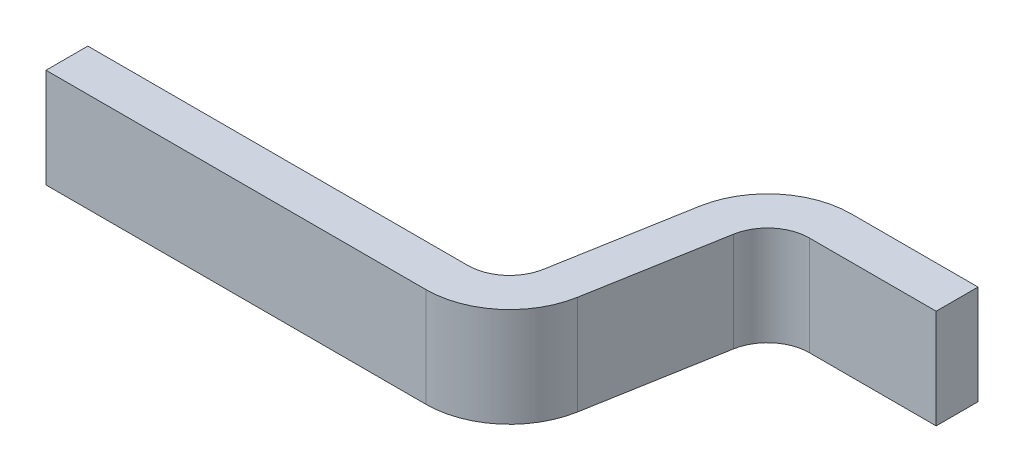
ISO-10303-21;
HEADER;
FILE_DESCRIPTION(('STEP AP214'),'2;1');
FILE_NAME('part.step','',(''),(''),'','','');
FILE_SCHEMA(('AUTOMOTIVE_DESIGN { 1 0 10303 214 1 1 1 1 }'));
ENDSEC;
DATA;
#1=APPLICATION_CONTEXT('core data for automotive mechanical design processes');
#2=APPLICATION_PROTOCOL_DEFINITION('international standard','automotive_design',2000,#1);
#3=PRODUCT_CONTEXT('',#1,'mechanical');
#4=PRODUCT('Part','Part','',(#3));
#5=PRODUCT_RELATED_PRODUCT_CATEGORY('part','',(#4));
#6=PRODUCT_DEFINITION_FORMATION('','',#4);
#7=PRODUCT_DEFINITION_CONTEXT('part definition',#1,'design');
#8=PRODUCT_DEFINITION('design','',#6,#7);
#9=PRODUCT_DEFINITION_SHAPE('','',#8);
#10=(LENGTH_UNIT() NAMED_UNIT(*) SI_UNIT(.MILLI.,.METRE.));
#11=(NAMED_UNIT(*) PLANE_ANGLE_UNIT() SI_UNIT($,.RADIAN.));
#12=(NAMED_UNIT(*) SI_UNIT($,.STERADIAN.) SOLID_ANGLE_UNIT());
#13=UNCERTAINTY_MEASURE_WITH_UNIT(LENGTH_MEASURE(1.E-05),#10,'distance_accuracy_value','');
#14=(GEOMETRIC_REPRESENTATION_CONTEXT(3) GLOBAL_UNCERTAINTY_ASSIGNED_CONTEXT((#13)) GLOBAL_UNIT_ASSIGNED_CONTEXT((#10,
#11,#12)) REPRESENTATION_CONTEXT('',''));
#15=CARTESIAN_POINT('',(0.,0.,0.));
#16=DIRECTION('',(0.,0.,1.));
#17=DIRECTION('',(1.,0.,0.));
#18=AXIS2_PLACEMENT_3D('',#15,#16,#17);
#19=CARTESIAN_POINT('',(2.518923101205,0.2375,0.2));
#20=DIRECTION('',(0.,0.,-1.));
#21=DIRECTION('',(-1.,0.,0.));
#22=AXIS2_PLACEMENT_3D('',#19,#20,#21);
#23=PLANE('',#22);
#24=DIRECTION('',(1.,0.,0.));
#25=VECTOR('',#24,1.);
#26=CARTESIAN_POINT('',(2.518923101205,0.2375,0.2));
#27=LINE('',#26,#25);
#28=CARTESIAN_POINT('',(3.125,0.2375,0.2));
#29=VERTEX_POINT('',#28);
#30=CARTESIAN_POINT('',(2.518923101205,0.2375,0.2));
#31=VERTEX_POINT('',#30);
#32=EDGE_CURVE('E166',#29,#31,#27,.F.);
#33=ORIENTED_EDGE('',*,*,#32,.T.);
#34=DIRECTION('',(0.,-1.,0.));
#35=VECTOR('',#34,1.);
#36=CARTESIAN_POINT('',(2.518923101205,0.2375,0.2));
#37=LINE('',#36,#35);
#38=CARTESIAN_POINT('',(2.518923101205,-0.2375,0.2));
#39=VERTEX_POINT('',#38);
#40=EDGE_CURVE('E100',#31,#39,#37,.T.);
#41=ORIENTED_EDGE('',*,*,#40,.T.);
#42=DIRECTION('',(1.,0.,0.));
#43=VECTOR('',#42,1.);
#44=CARTESIAN_POINT('',(2.518923101205,-0.2375,0.2));
#45=LINE('',#44,#43);
#46=CARTESIAN_POINT('',(3.125,-0.2375,0.2));
#47=VERTEX_POINT('',#46);
#48=EDGE_CURVE('E145',#39,#47,#45,.T.);
#49=ORIENTED_EDGE('',*,*,#48,.T.);
#50=DIRECTION('',(0.,1.,0.));
#51=VECTOR('',#50,1.);
#52=CARTESIAN_POINT('',(3.125,-0.2375,0.2));
#53=LINE('',#52,#51);
#54=EDGE_CURVE('E163',#47,#29,#53,.T.);
#55=ORIENTED_EDGE('',*,*,#54,.T.);
#56=EDGE_LOOP('',(#33,#41,#49,#55));
#57=FACE_BOUND('',#56,.T.);
#58=ADVANCED_FACE('F16',(#57),#23,.F.);
#59=CARTESIAN_POINT('',(3.125,-0.2375,0.));
#60=DIRECTION('',(-1.,0.,0.));
#61=DIRECTION('',(0.,0.,1.));
#62=AXIS2_PLACEMENT_3D('',#59,#60,#61);
#63=PLANE('',#62);
#64=DIRECTION('',(0.,0.,1.));
#65=VECTOR('',#64,1.);
#66=CARTESIAN_POINT('',(3.125,0.2375,0.));
#67=LINE('',#66,#65);
#68=CARTESIAN_POINT('',(3.125,0.2375,0.));
#69=VERTEX_POINT('',#68);
#70=EDGE_CURVE('E149',#29,#69,#67,.F.);
#71=ORIENTED_EDGE('',*,*,#70,.F.);
#72=ORIENTED_EDGE('',*,*,#54,.F.);
#73=DIRECTION('',(0.,0.,1.));
#74=VECTOR('',#73,1.);
#75=CARTESIAN_POINT('',(3.125,-0.2375,0.2));
#76=LINE('',#75,#74);
#77=CARTESIAN_POINT('',(3.125,-0.2375,0.));
#78=VERTEX_POINT('',#77);
#79=EDGE_CURVE('E144',#47,#78,#76,.F.);
#80=ORIENTED_EDGE('',*,*,#79,.T.);
#81=DIRECTION('',(0.,1.,0.));
#82=VECTOR('',#81,1.);
#83=CARTESIAN_POINT('',(3.125,-0.2375,0.));
#84=LINE('',#83,#82);
#85=EDGE_CURVE('E135',#78,#69,#84,.T.);
#86=ORIENTED_EDGE('',*,*,#85,.T.);
#87=EDGE_LOOP('',(#71,#72,#80,#86));
#88=FACE_BOUND('',#87,.T.);
#89=ADVANCED_FACE('F297',(#88),#63,.F.);
#90=CARTESIAN_POINT('',(2.518923101205,0.2375,0.4));
#91=DIRECTION('',(0.,-1.,0.));
#92=DIRECTION('',(0.,0.,-1.));
#93=AXIS2_PLACEMENT_3D('',#90,#91,#92);
#94=CYLINDRICAL_SURFACE('',#93,0.2);
#95=CARTESIAN_POINT('',(2.518923101205,0.2375,0.4));
#96=DIRECTION('',(0.,-1.,0.));
#97=DIRECTION('',(0.,0.,-1.));
#98=AXIS2_PLACEMENT_3D('',#95,#96,#97);
#99=CIRCLE('',#98,0.2);
#100=CARTESIAN_POINT('',(2.32196155060234,0.2375,0.365270364466908));
#101=VERTEX_POINT('',#100);
#102=EDGE_CURVE('E19',#101,#31,#99,.T.);
#103=ORIENTED_EDGE('',*,*,#102,.F.);
#104=DIRECTION('',(0.,1.,0.));
#105=VECTOR('',#104,1.);
#106=CARTESIAN_POINT('',(2.32196155060263,0.2375,0.365270364467111));
#107=LINE('',#106,#105);
#108=CARTESIAN_POINT('',(2.32196155060234,-0.2375,0.365270364466908));
#109=VERTEX_POINT('',#108);
#110=EDGE_CURVE('E90',#101,#109,#107,.F.);
#111=ORIENTED_EDGE('',*,*,#110,.T.);
#112=CARTESIAN_POINT('',(2.518923101205,-0.2375,0.4));
#113=DIRECTION('',(0.,-1.,0.));
#114=DIRECTION('',(0.,0.,-1.));
#115=AXIS2_PLACEMENT_3D('',#112,#113,#114);
#116=CIRCLE('',#115,0.2);
#117=EDGE_CURVE('E158',#39,#109,#116,.F.);
#118=ORIENTED_EDGE('',*,*,#117,.F.);
#119=ORIENTED_EDGE('',*,*,#40,.F.);
#120=EDGE_LOOP('',(#103,#111,#118,#119));
#121=FACE_BOUND('',#120,.T.);
#122=ADVANCED_FACE('F116',(#121),#94,.F.);
#123=CARTESIAN_POINT('',(2.210136935503,0.2375,0.999459271067));
#124=DIRECTION('',(-0.98480775301219,0.,-0.173648177667033));
#125=DIRECTION('',(-0.173648177667033,0.,0.98480775301219));
#126=AXIS2_PLACEMENT_3D('',#123,#124,#125);
#127=PLANE('',#126);
#128=DIRECTION('',(-0.173648177666056,0.,0.984807753012362));
#129=VECTOR('',#128,1.);
#130=CARTESIAN_POINT('',(2.321961550602,0.2375,0.365270364467));
#131=LINE('',#130,#129);
#132=CARTESIAN_POINT('',(2.21013693550297,0.2375,0.999459271066712));
#133=VERTEX_POINT('',#132);
#134=EDGE_CURVE('E94',#101,#133,#131,.T.);
#135=ORIENTED_EDGE('',*,*,#134,.T.);
#136=DIRECTION('',(0.,1.,0.));
#137=VECTOR('',#136,1.);
#138=CARTESIAN_POINT('',(2.21013693550285,0.2375,0.999459271066973));
#139=LINE('',#138,#137);
#140=CARTESIAN_POINT('',(2.21013693550297,-0.2375,0.999459271066712));
#141=VERTEX_POINT('',#140);
#142=EDGE_CURVE('E113',#141,#133,#139,.T.);
#143=ORIENTED_EDGE('',*,*,#142,.F.);
#144=DIRECTION('',(0.173648177666056,0.,-0.984807753012362));
#145=VECTOR('',#144,1.);
#146=CARTESIAN_POINT('',(2.210136935503,-0.2375,0.999459271067));
#147=LINE('',#146,#145);
#148=EDGE_CURVE('E95',#141,#109,#147,.T.);
#149=ORIENTED_EDGE('',*,*,#148,.T.);
#150=ORIENTED_EDGE('',*,*,#110,.F.);
#151=EDGE_LOOP('',(#135,#143,#149,#150));
#152=FACE_BOUND('',#151,.T.);
#153=ADVANCED_FACE('F92',(#152),#127,.F.);
#154=CARTESIAN_POINT('',(2.518923101205,-0.2375,0.));
#155=DIRECTION('',(0.,0.,1.));
#156=DIRECTION('',(1.,0.,0.));
#157=AXIS2_PLACEMENT_3D('',#154,#155,#156);
#158=PLANE('',#157);
#159=DIRECTION('',(1.,0.,0.));
#160=VECTOR('',#159,1.);
#161=CARTESIAN_POINT('',(2.518923101205,-0.2375,0.));
#162=LINE('',#161,#160);
#163=CARTESIAN_POINT('',(2.518923101205,-0.2375,0.));
#164=VERTEX_POINT('',#163);
#165=EDGE_CURVE('E125',#164,#78,#162,.T.);
#166=ORIENTED_EDGE('',*,*,#165,.F.);
#167=DIRECTION('',(0.,-1.,0.));
#168=VECTOR('',#167,1.);
#169=CARTESIAN_POINT('',(2.518923101205,-0.2375,0.));
#170=LINE('',#169,#168);
#171=CARTESIAN_POINT('',(2.518923101205,0.2375,0.));
#172=VERTEX_POINT('',#171);
#173=EDGE_CURVE('E194',#172,#164,#170,.T.);
#174=ORIENTED_EDGE('',*,*,#173,.F.);
#175=DIRECTION('',(1.,0.,0.));
#176=VECTOR('',#175,1.);
#177=CARTESIAN_POINT('',(2.518923101205,0.2375,0.));
#178=LINE('',#177,#176);
#179=EDGE_CURVE('E119',#69,#172,#178,.F.);
#180=ORIENTED_EDGE('',*,*,#179,.F.);
#181=ORIENTED_EDGE('',*,*,#85,.F.);
#182=EDGE_LOOP('',(#166,#174,#180,#181));
#183=FACE_BOUND('',#182,.T.);
#184=ADVANCED_FACE('F299',(#183),#158,.F.);
#185=CARTESIAN_POINT('',(1.816213834298,0.2375,0.93));
#186=DIRECTION('',(0.,1.,0.));
#187=DIRECTION('',(0.,0.,1.));
#188=AXIS2_PLACEMENT_3D('',#185,#186,#187);
#189=CYLINDRICAL_SURFACE('',#188,0.4);
#190=CARTESIAN_POINT('',(1.816213834298,0.2375,0.93));
#191=DIRECTION('',(0.,1.,0.));
#192=DIRECTION('',(0.,0.,1.));
#193=AXIS2_PLACEMENT_3D('',#190,#191,#192);
#194=CIRCLE('',#193,0.4);
#195=CARTESIAN_POINT('',(1.816213834298,0.2375,1.33));
#196=VERTEX_POINT('',#195);
#197=EDGE_CURVE('E111',#196,#133,#194,.T.);
#198=ORIENTED_EDGE('',*,*,#197,.F.);
#199=DIRECTION('',(0.,1.,0.));
#200=VECTOR('',#199,1.);
#201=CARTESIAN_POINT('',(1.816213834298,0.2375,1.33));
#202=LINE('',#201,#200);
#203=CARTESIAN_POINT('',(1.816213834298,-0.2375,1.33));
#204=VERTEX_POINT('',#203);
#205=EDGE_CURVE('E190',#196,#204,#202,.F.);
#206=ORIENTED_EDGE('',*,*,#205,.T.);
#207=CARTESIAN_POINT('',(1.816213834298,-0.2375,0.93));
#208=DIRECTION('',(0.,1.,0.));
#209=DIRECTION('',(0.,0.,1.));
#210=AXIS2_PLACEMENT_3D('',#207,#208,#209);
#211=CIRCLE('',#210,0.4);
#212=EDGE_CURVE('E184',#141,#204,#211,.F.);
#213=ORIENTED_EDGE('',*,*,#212,.F.);
#214=ORIENTED_EDGE('',*,*,#142,.T.);
#215=EDGE_LOOP('',(#198,#206,#213,#214));
#216=FACE_BOUND('',#215,.T.);
#217=ADVANCED_FACE('F301',(#216),#189,.T.);
#218=CARTESIAN_POINT('',(2.518923101205,-0.2375,0.4));
#219=DIRECTION('',(0.,-1.,0.));
#220=DIRECTION('',(0.,0.,-1.));
#221=AXIS2_PLACEMENT_3D('',#218,#219,#220);
#222=CYLINDRICAL_SURFACE('',#221,0.4);
#223=CARTESIAN_POINT('',(2.518923101205,-0.2375,0.4));
#224=DIRECTION('',(0.,-1.,0.));
#225=DIRECTION('',(0.,0.,-1.));
#226=AXIS2_PLACEMENT_3D('',#223,#224,#225);
#227=CIRCLE('',#226,0.4);
#228=CARTESIAN_POINT('',(2.12499999999989,-0.2375,0.330540728933063));
#229=VERTEX_POINT('',#228);
#230=EDGE_CURVE('E191',#164,#229,#227,.F.);
#231=ORIENTED_EDGE('',*,*,#230,.T.);
#232=DIRECTION('',(0.,1.,0.));
#233=VECTOR('',#232,1.);
#234=CARTESIAN_POINT('',(2.12499999999966,-0.2375,0.33054072893294));
#235=LINE('',#234,#233);
#236=CARTESIAN_POINT('',(2.12499999999989,0.2375,0.330540728933063));
#237=VERTEX_POINT('',#236);
#238=EDGE_CURVE('E206',#229,#237,#235,.T.);
#239=ORIENTED_EDGE('',*,*,#238,.T.);
#240=CARTESIAN_POINT('',(2.518923101205,0.2375,0.4));
#241=DIRECTION('',(0.,-1.,0.));
#242=DIRECTION('',(0.,0.,-1.));
#243=AXIS2_PLACEMENT_3D('',#240,#241,#242);
#244=CIRCLE('',#243,0.4);
#245=EDGE_CURVE('E195',#237,#172,#244,.T.);
#246=ORIENTED_EDGE('',*,*,#245,.T.);
#247=ORIENTED_EDGE('',*,*,#173,.T.);
#248=EDGE_LOOP('',(#231,#239,#246,#247));
#249=FACE_BOUND('',#248,.T.);
#250=ADVANCED_FACE('F216',(#249),#222,.T.);
#251=CARTESIAN_POINT('',(0.,0.2375,1.33));
#252=DIRECTION('',(0.,0.,-1.));
#253=DIRECTION('',(-1.,0.,0.));
#254=AXIS2_PLACEMENT_3D('',#251,#252,#253);
#255=PLANE('',#254);
#256=DIRECTION('',(1.,0.,0.));
#257=VECTOR('',#256,1.);
#258=CARTESIAN_POINT('',(0.,0.2375,1.33));
#259=LINE('',#258,#257);
#260=CARTESIAN_POINT('',(0.,0.2375,1.33));
#261=VERTEX_POINT('',#260);
#262=EDGE_CURVE('E230',#196,#261,#259,.F.);
#263=ORIENTED_EDGE('',*,*,#262,.T.);
#264=DIRECTION('',(0.,1.,0.));
#265=VECTOR('',#264,1.);
#266=CARTESIAN_POINT('',(0.,-0.2375,1.33));
#267=LINE('',#266,#265);
#268=CARTESIAN_POINT('',(0.,-0.2375,1.33));
#269=VERTEX_POINT('',#268);
#270=EDGE_CURVE('E253',#269,#261,#267,.T.);
#271=ORIENTED_EDGE('',*,*,#270,.F.);
#272=DIRECTION('',(1.,0.,0.));
#273=VECTOR('',#272,1.);
#274=CARTESIAN_POINT('',(0.,-0.2375,1.33));
#275=LINE('',#274,#273);
#276=EDGE_CURVE('E183',#269,#204,#275,.T.);
#277=ORIENTED_EDGE('',*,*,#276,.T.);
#278=ORIENTED_EDGE('',*,*,#205,.F.);
#279=EDGE_LOOP('',(#263,#271,#277,#278));
#280=FACE_BOUND('',#279,.T.);
#281=ADVANCED_FACE('F326',(#280),#255,.F.);
#282=CARTESIAN_POINT('',(2.0131753849,-0.2375,0.964729635533));
#283=DIRECTION('',(0.98480775301219,0.,0.173648177667033));
#284=DIRECTION('',(0.173648177667033,0.,-0.98480775301219));
#285=AXIS2_PLACEMENT_3D('',#282,#283,#284);
#286=PLANE('',#285);
#287=DIRECTION('',(0.173648177667033,0.,-0.98480775301219));
#288=VECTOR('',#287,1.);
#289=CARTESIAN_POINT('',(2.0131753849,-0.2375,0.964729635533));
#290=LINE('',#289,#288);
#291=CARTESIAN_POINT('',(2.01317538490022,-0.2375,0.964729635533203));
#292=VERTEX_POINT('',#291);
#293=EDGE_CURVE('E224',#292,#229,#290,.T.);
#294=ORIENTED_EDGE('',*,*,#293,.F.);
#295=DIRECTION('',(0.,1.,0.));
#296=VECTOR('',#295,1.);
#297=CARTESIAN_POINT('',(2.01317538490049,-0.2375,0.964729635533087));
#298=LINE('',#297,#296);
#299=CARTESIAN_POINT('',(2.01317538490022,0.2375,0.964729635533203));
#300=VERTEX_POINT('',#299);
#301=EDGE_CURVE('E178',#292,#300,#298,.T.);
#302=ORIENTED_EDGE('',*,*,#301,.T.);
#303=DIRECTION('',(0.173648177667033,0.,-0.98480775301219));
#304=VECTOR('',#303,1.);
#305=CARTESIAN_POINT('',(2.0131753849,0.2375,0.964729635533));
#306=LINE('',#305,#304);
#307=EDGE_CURVE('E187',#237,#300,#306,.F.);
#308=ORIENTED_EDGE('',*,*,#307,.F.);
#309=ORIENTED_EDGE('',*,*,#238,.F.);
#310=EDGE_LOOP('',(#294,#302,#308,#309));
#311=FACE_BOUND('',#310,.T.);
#312=ADVANCED_FACE('F323',(#311),#286,.F.);
#313=CARTESIAN_POINT('',(0.,0.2375,1.13));
#314=DIRECTION('',(0.,-1.,0.));
#315=DIRECTION('',(0.,0.,-1.));
#316=AXIS2_PLACEMENT_3D('',#313,#314,#315);
#317=PLANE('',#316);
#318=DIRECTION('',(1.,0.,0.));
#319=VECTOR('',#318,1.);
#320=CARTESIAN_POINT('',(0.,0.2375,1.13));
#321=LINE('',#320,#319);
#322=CARTESIAN_POINT('',(1.816213834298,0.2375,1.13));
#323=VERTEX_POINT('',#322);
#324=CARTESIAN_POINT('',(0.,0.2375,1.13));
#325=VERTEX_POINT('',#324);
#326=EDGE_CURVE('E236',#323,#325,#321,.F.);
#327=ORIENTED_EDGE('',*,*,#326,.T.);
#328=DIRECTION('',(0.,0.,1.));
#329=VECTOR('',#328,1.);
#330=CARTESIAN_POINT('',(0.,0.2375,1.13));
#331=LINE('',#330,#329);
#332=EDGE_CURVE('E250',#261,#325,#331,.F.);
#333=ORIENTED_EDGE('',*,*,#332,.F.);
#334=ORIENTED_EDGE('',*,*,#262,.F.);
#335=ORIENTED_EDGE('',*,*,#197,.T.);
#336=ORIENTED_EDGE('',*,*,#134,.F.);
#337=ORIENTED_EDGE('',*,*,#102,.T.);
#338=ORIENTED_EDGE('',*,*,#32,.F.);
#339=ORIENTED_EDGE('',*,*,#70,.T.);
#340=ORIENTED_EDGE('',*,*,#179,.T.);
#341=ORIENTED_EDGE('',*,*,#245,.F.);
#342=ORIENTED_EDGE('',*,*,#307,.T.);
#343=CARTESIAN_POINT('',(1.816213834298,0.2375,0.93));
#344=DIRECTION('',(0.,1.,0.));
#345=DIRECTION('',(0.,0.,1.));
#346=AXIS2_PLACEMENT_3D('',#343,#344,#345);
#347=CIRCLE('',#346,0.2);
#348=EDGE_CURVE('E179',#300,#323,#347,.F.);
#349=ORIENTED_EDGE('',*,*,#348,.T.);
#350=EDGE_LOOP('',(#327,#333,#334,#335,#336,#337,#338,#339,#340,#341,#342,#349));
#351=FACE_BOUND('',#350,.T.);
#352=ADVANCED_FACE('F106',(#351),#317,.F.);
#353=CARTESIAN_POINT('',(0.,-0.2375,1.13));
#354=DIRECTION('',(-1.,0.,0.));
#355=DIRECTION('',(0.,0.,1.));
#356=AXIS2_PLACEMENT_3D('',#353,#354,#355);
#357=PLANE('',#356);
#358=ORIENTED_EDGE('',*,*,#332,.T.);
#359=DIRECTION('',(0.,1.,0.));
#360=VECTOR('',#359,1.);
#361=CARTESIAN_POINT('',(0.,-0.2375,1.13));
#362=LINE('',#361,#360);
#363=CARTESIAN_POINT('',(0.,-0.2375,1.13));
#364=VERTEX_POINT('',#363);
#365=EDGE_CURVE('E238',#325,#364,#362,.F.);
#366=ORIENTED_EDGE('',*,*,#365,.T.);
#367=DIRECTION('',(0.,0.,1.));
#368=VECTOR('',#367,1.);
#369=CARTESIAN_POINT('',(0.,-0.2375,1.33));
#370=LINE('',#369,#368);
#371=EDGE_CURVE('E241',#364,#269,#370,.T.);
#372=ORIENTED_EDGE('',*,*,#371,.T.);
#373=ORIENTED_EDGE('',*,*,#270,.T.);
#374=EDGE_LOOP('',(#358,#366,#372,#373));
#375=FACE_BOUND('',#374,.T.);
#376=ADVANCED_FACE('F274',(#375),#357,.T.);
#377=CARTESIAN_POINT('',(0.,-0.2375,1.33));
#378=DIRECTION('',(0.,1.,0.));
#379=DIRECTION('',(0.,0.,1.));
#380=AXIS2_PLACEMENT_3D('',#377,#378,#379);
#381=PLANE('',#380);
#382=ORIENTED_EDGE('',*,*,#276,.F.);
#383=ORIENTED_EDGE('',*,*,#371,.F.);
#384=DIRECTION('',(1.,0.,0.));
#385=VECTOR('',#384,1.);
#386=CARTESIAN_POINT('',(0.,-0.2375,1.13));
#387=LINE('',#386,#385);
#388=CARTESIAN_POINT('',(1.816213834298,-0.2375,1.13));
#389=VERTEX_POINT('',#388);
#390=EDGE_CURVE('E26',#364,#389,#387,.T.);
#391=ORIENTED_EDGE('',*,*,#390,.T.);
#392=CARTESIAN_POINT('',(1.816213834298,-0.2375,0.93));
#393=DIRECTION('',(0.,1.,0.));
#394=DIRECTION('',(0.,0.,1.));
#395=AXIS2_PLACEMENT_3D('',#392,#393,#394);
#396=CIRCLE('',#395,0.2);
#397=EDGE_CURVE('E34',#389,#292,#396,.T.);
#398=ORIENTED_EDGE('',*,*,#397,.T.);
#399=ORIENTED_EDGE('',*,*,#293,.T.);
#400=ORIENTED_EDGE('',*,*,#230,.F.);
#401=ORIENTED_EDGE('',*,*,#165,.T.);
#402=ORIENTED_EDGE('',*,*,#79,.F.);
#403=ORIENTED_EDGE('',*,*,#48,.F.);
#404=ORIENTED_EDGE('',*,*,#117,.T.);
#405=ORIENTED_EDGE('',*,*,#148,.F.);
#406=ORIENTED_EDGE('',*,*,#212,.T.);
#407=EDGE_LOOP('',(#382,#383,#391,#398,#399,#400,#401,#402,#403,#404,#405,#406));
#408=FACE_BOUND('',#407,.T.);
#409=ADVANCED_FACE('F222',(#408),#381,.F.);
#410=CARTESIAN_POINT('',(1.816213834298,-0.2375,0.93));
#411=DIRECTION('',(0.,1.,0.));
#412=DIRECTION('',(0.,0.,1.));
#413=AXIS2_PLACEMENT_3D('',#410,#411,#412);
#414=CYLINDRICAL_SURFACE('',#413,0.2);
#415=ORIENTED_EDGE('',*,*,#397,.F.);
#416=DIRECTION('',(0.,1.,0.));
#417=VECTOR('',#416,1.);
#418=CARTESIAN_POINT('',(1.816213834298,-0.2375,1.13));
#419=LINE('',#418,#417);
#420=EDGE_CURVE('E11',#389,#323,#419,.T.);
#421=ORIENTED_EDGE('',*,*,#420,.T.);
#422=ORIENTED_EDGE('',*,*,#348,.F.);
#423=ORIENTED_EDGE('',*,*,#301,.F.);
#424=EDGE_LOOP('',(#415,#421,#422,#423));
#425=FACE_BOUND('',#424,.T.);
#426=ADVANCED_FACE('F280',(#425),#414,.F.);
#427=CARTESIAN_POINT('',(0.,-0.2375,1.13));
#428=DIRECTION('',(0.,0.,1.));
#429=DIRECTION('',(1.,0.,0.));
#430=AXIS2_PLACEMENT_3D('',#427,#428,#429);
#431=PLANE('',#430);
#432=ORIENTED_EDGE('',*,*,#390,.F.);
#433=ORIENTED_EDGE('',*,*,#365,.F.);
#434=ORIENTED_EDGE('',*,*,#326,.F.);
#435=ORIENTED_EDGE('',*,*,#420,.F.);
#436=EDGE_LOOP('',(#432,#433,#434,#435));
#437=FACE_BOUND('',#436,.T.);
#438=ADVANCED_FACE('F279',(#437),#431,.F.);
#439=CLOSED_SHELL('',(#58,#89,#122,#153,#184,#217,#250,#281,#312,#352,#376,#409,#426,#438));
#440=MANIFOLD_SOLID_BREP('B1',#439);
#441=ADVANCED_BREP_SHAPE_REPRESENTATION('',(#18,#440),#14);
#442=SHAPE_DEFINITION_REPRESENTATION(#9,#441);
ENDSEC;
END-ISO-10303-21;
